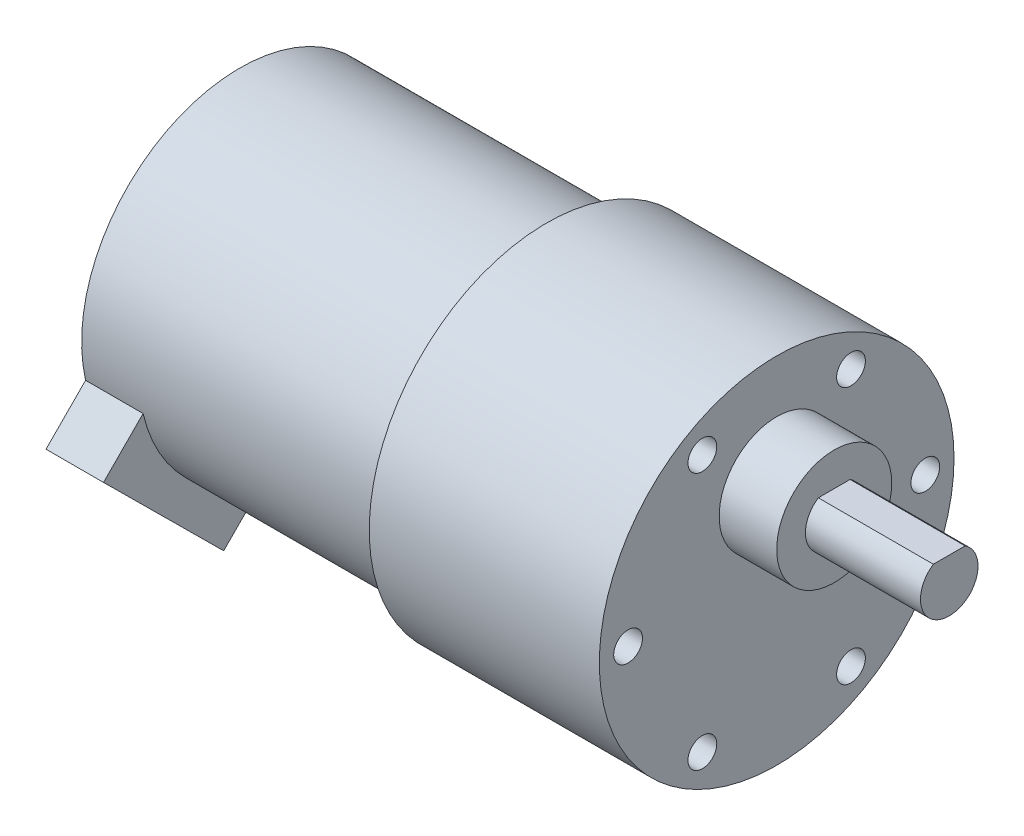
ISO-10303-21;
HEADER;
FILE_DESCRIPTION(('STEP AP214'),'2;1');
FILE_NAME('part.step','',(''),(''),'','','');
FILE_SCHEMA(('AUTOMOTIVE_DESIGN { 1 0 10303 214 1 1 1 1 }'));
ENDSEC;
DATA;
#1=APPLICATION_CONTEXT('core data for automotive mechanical design processes');
#2=APPLICATION_PROTOCOL_DEFINITION('international standard','automotive_design',2000,#1);
#3=PRODUCT_CONTEXT('',#1,'mechanical');
#4=PRODUCT('Part','Part','',(#3));
#5=PRODUCT_RELATED_PRODUCT_CATEGORY('part','',(#4));
#6=PRODUCT_DEFINITION_FORMATION('','',#4);
#7=PRODUCT_DEFINITION_CONTEXT('part definition',#1,'design');
#8=PRODUCT_DEFINITION('design','',#6,#7);
#9=PRODUCT_DEFINITION_SHAPE('','',#8);
#10=(LENGTH_UNIT() NAMED_UNIT(*) SI_UNIT(.MILLI.,.METRE.));
#11=(NAMED_UNIT(*) PLANE_ANGLE_UNIT() SI_UNIT($,.RADIAN.));
#12=(NAMED_UNIT(*) SI_UNIT($,.STERADIAN.) SOLID_ANGLE_UNIT());
#13=UNCERTAINTY_MEASURE_WITH_UNIT(LENGTH_MEASURE(1.E-05),#10,'distance_accuracy_value','');
#14=(GEOMETRIC_REPRESENTATION_CONTEXT(3) GLOBAL_UNCERTAINTY_ASSIGNED_CONTEXT((#13)) GLOBAL_UNIT_ASSIGNED_CONTEXT((#10,
#11,#12)) REPRESENTATION_CONTEXT('',''));
#15=CARTESIAN_POINT('',(0.,0.,0.));
#16=DIRECTION('',(0.,0.,1.));
#17=DIRECTION('',(1.,0.,0.));
#18=AXIS2_PLACEMENT_3D('',#15,#16,#17);
#19=CARTESIAN_POINT('',(30.,7.,0.));
#20=DIRECTION('',(1.,0.,0.));
#21=DIRECTION('',(0.,0.,-1.));
#22=AXIS2_PLACEMENT_3D('',#19,#20,#21);
#23=PLANE('',#22);
#24=CARTESIAN_POINT('',(30.,7.,0.));
#25=DIRECTION('',(1.,0.,0.));
#26=DIRECTION('',(0.,0.,-1.));
#27=AXIS2_PLACEMENT_3D('',#24,#25,#26);
#28=CIRCLE('',#27,6.);
#29=CARTESIAN_POINT('',(30.,7.,-6.));
#30=VERTEX_POINT('',#29);
#31=EDGE_CURVE('E137',#30,#30,#28,.T.);
#32=ORIENTED_EDGE('',*,*,#31,.T.);
#33=EDGE_LOOP('',(#32));
#34=FACE_BOUND('',#33,.T.);
#35=DIRECTION('',(0.,0.,1.));
#36=VECTOR('',#35,1.);
#37=CARTESIAN_POINT('',(30.,9.5,1.6583123951777));
#38=LINE('',#37,#36);
#39=CARTESIAN_POINT('',(30.,9.5,-1.6583123951777));
#40=VERTEX_POINT('',#39);
#41=CARTESIAN_POINT('',(30.,9.5,1.6583123951777));
#42=VERTEX_POINT('',#41);
#43=EDGE_CURVE('E128',#40,#42,#38,.T.);
#44=ORIENTED_EDGE('',*,*,#43,.F.);
#45=CARTESIAN_POINT('',(30.,7.,0.));
#46=DIRECTION('',(1.,0.,0.));
#47=DIRECTION('',(0.,0.,-1.));
#48=AXIS2_PLACEMENT_3D('',#45,#46,#47);
#49=CIRCLE('',#48,3.);
#50=EDGE_CURVE('E58',#42,#40,#49,.T.);
#51=ORIENTED_EDGE('',*,*,#50,.F.);
#52=EDGE_LOOP('',(#44,#51));
#53=FACE_BOUND('',#52,.T.);
#54=ADVANCED_FACE('F35',(#34,#53),#23,.T.);
#55=CARTESIAN_POINT('',(24.,0.,0.));
#56=DIRECTION('',(-1.,0.,0.));
#57=DIRECTION('',(0.,0.,1.));
#58=AXIS2_PLACEMENT_3D('',#55,#56,#57);
#59=CYLINDRICAL_SURFACE('',#58,18.5);
#60=CARTESIAN_POINT('',(24.,0.,0.));
#61=DIRECTION('',(1.,0.,0.));
#62=DIRECTION('',(0.,0.,-1.));
#63=AXIS2_PLACEMENT_3D('',#60,#61,#62);
#64=CIRCLE('',#63,18.5);
#65=CARTESIAN_POINT('',(24.,0.,-18.5));
#66=VERTEX_POINT('',#65);
#67=EDGE_CURVE('E181',#66,#66,#64,.T.);
#68=ORIENTED_EDGE('',*,*,#67,.F.);
#69=EDGE_LOOP('',(#68));
#70=FACE_BOUND('',#69,.T.);
#71=CARTESIAN_POINT('',(0.,0.,0.));
#72=DIRECTION('',(1.,0.,0.));
#73=DIRECTION('',(0.,0.,-1.));
#74=AXIS2_PLACEMENT_3D('',#71,#72,#73);
#75=CIRCLE('',#74,18.5);
#76=CARTESIAN_POINT('',(0.,0.,-18.5));
#77=VERTEX_POINT('',#76);
#78=EDGE_CURVE('E180',#77,#77,#75,.T.);
#79=ORIENTED_EDGE('',*,*,#78,.T.);
#80=EDGE_LOOP('',(#79));
#81=FACE_BOUND('',#80,.T.);
#82=ADVANCED_FACE('F37',(#70,#81),#59,.T.);
#83=CARTESIAN_POINT('',(24.,0.,0.));
#84=DIRECTION('',(1.,0.,0.));
#85=DIRECTION('',(0.,0.,-1.));
#86=AXIS2_PLACEMENT_3D('',#83,#84,#85);
#87=PLANE('',#86);
#88=CARTESIAN_POINT('',(24.,7.,0.));
#89=DIRECTION('',(1.,0.,0.));
#90=DIRECTION('',(0.,0.,-1.));
#91=AXIS2_PLACEMENT_3D('',#88,#89,#90);
#92=CIRCLE('',#91,6.);
#93=CARTESIAN_POINT('',(24.,7.,-6.));
#94=VERTEX_POINT('',#93);
#95=EDGE_CURVE('E136',#94,#94,#92,.T.);
#96=ORIENTED_EDGE('',*,*,#95,.F.);
#97=EDGE_LOOP('',(#96));
#98=FACE_BOUND('',#97,.T.);
#99=CARTESIAN_POINT('',(24.,-13.4233937586588,-7.74999999999997));
#100=DIRECTION('',(1.,0.,0.));
#101=DIRECTION('',(0.,0.,-1.));
#102=AXIS2_PLACEMENT_3D('',#99,#100,#101);
#103=CIRCLE('',#102,1.5);
#104=CARTESIAN_POINT('',(24.,-13.4233937586588,-9.24999999999997));
#105=VERTEX_POINT('',#104);
#106=EDGE_CURVE('E147',#105,#105,#103,.T.);
#107=ORIENTED_EDGE('',*,*,#106,.F.);
#108=EDGE_LOOP('',(#107));
#109=FACE_BOUND('',#108,.T.);
#110=CARTESIAN_POINT('',(24.,-13.4233937586588,7.75000000000006));
#111=DIRECTION('',(1.,0.,0.));
#112=DIRECTION('',(0.,0.,-1.));
#113=AXIS2_PLACEMENT_3D('',#110,#111,#112);
#114=CIRCLE('',#113,1.5);
#115=CARTESIAN_POINT('',(24.,-13.4233937586588,6.25000000000006));
#116=VERTEX_POINT('',#115);
#117=EDGE_CURVE('E153',#116,#116,#114,.T.);
#118=ORIENTED_EDGE('',*,*,#117,.F.);
#119=EDGE_LOOP('',(#118));
#120=FACE_BOUND('',#119,.T.);
#121=CARTESIAN_POINT('',(24.,1.08235921504137E-13,15.5));
#122=DIRECTION('',(1.,0.,0.));
#123=DIRECTION('',(0.,0.,-1.));
#124=AXIS2_PLACEMENT_3D('',#121,#122,#123);
#125=CIRCLE('',#124,1.5);
#126=CARTESIAN_POINT('',(24.,1.08235921504137E-13,14.));
#127=VERTEX_POINT('',#126);
#128=EDGE_CURVE('E159',#127,#127,#125,.T.);
#129=ORIENTED_EDGE('',*,*,#128,.F.);
#130=EDGE_LOOP('',(#129));
#131=FACE_BOUND('',#130,.T.);
#132=CARTESIAN_POINT('',(24.,13.4233937586589,7.74999999999987));
#133=DIRECTION('',(1.,0.,0.));
#134=DIRECTION('',(0.,0.,-1.));
#135=AXIS2_PLACEMENT_3D('',#132,#133,#134);
#136=CIRCLE('',#135,1.5);
#137=CARTESIAN_POINT('',(24.,13.4233937586589,6.24999999999987));
#138=VERTEX_POINT('',#137);
#139=EDGE_CURVE('E165',#138,#138,#136,.T.);
#140=ORIENTED_EDGE('',*,*,#139,.F.);
#141=EDGE_LOOP('',(#140));
#142=FACE_BOUND('',#141,.T.);
#143=CARTESIAN_POINT('',(24.,13.4233937586587,-7.75000000000016));
#144=DIRECTION('',(1.,0.,0.));
#145=DIRECTION('',(0.,0.,-1.));
#146=AXIS2_PLACEMENT_3D('',#143,#144,#145);
#147=CIRCLE('',#146,1.5);
#148=CARTESIAN_POINT('',(24.,13.4233937586587,-9.25000000000016));
#149=VERTEX_POINT('',#148);
#150=EDGE_CURVE('E140',#149,#149,#147,.T.);
#151=ORIENTED_EDGE('',*,*,#150,.F.);
#152=EDGE_LOOP('',(#151));
#153=FACE_BOUND('',#152,.T.);
#154=CARTESIAN_POINT('',(24.,0.,-15.5));
#155=DIRECTION('',(1.,0.,0.));
#156=DIRECTION('',(0.,0.,-1.));
#157=AXIS2_PLACEMENT_3D('',#154,#155,#156);
#158=CIRCLE('',#157,1.5);
#159=CARTESIAN_POINT('',(24.,0.,-17.));
#160=VERTEX_POINT('',#159);
#161=EDGE_CURVE('E146',#160,#160,#158,.T.);
#162=ORIENTED_EDGE('',*,*,#161,.F.);
#163=EDGE_LOOP('',(#162));
#164=FACE_BOUND('',#163,.T.);
#165=ORIENTED_EDGE('',*,*,#67,.T.);
#166=EDGE_LOOP('',(#165));
#167=FACE_BOUND('',#166,.T.);
#168=ADVANCED_FACE('F193',(#98,#109,#120,#131,#142,#153,#164,#167),#87,.T.);
#169=CARTESIAN_POINT('',(0.,0.,0.));
#170=DIRECTION('',(1.,0.,0.));
#171=DIRECTION('',(0.,0.,-1.));
#172=AXIS2_PLACEMENT_3D('',#169,#170,#171);
#173=PLANE('',#172);
#174=CARTESIAN_POINT('',(0.,0.,0.));
#175=DIRECTION('',(1.,0.,0.));
#176=DIRECTION('',(0.,0.,-1.));
#177=AXIS2_PLACEMENT_3D('',#174,#175,#176);
#178=CIRCLE('',#177,16.5);
#179=CARTESIAN_POINT('',(0.,0.,-16.5));
#180=VERTEX_POINT('',#179);
#181=EDGE_CURVE('E43',#180,#180,#178,.F.);
#182=ORIENTED_EDGE('',*,*,#181,.F.);
#183=EDGE_LOOP('',(#182));
#184=FACE_BOUND('',#183,.T.);
#185=ORIENTED_EDGE('',*,*,#78,.F.);
#186=EDGE_LOOP('',(#185));
#187=FACE_BOUND('',#186,.T.);
#188=ADVANCED_FACE('F190',(#184,#187),#173,.F.);
#189=CARTESIAN_POINT('',(-32.,0.,0.));
#190=DIRECTION('',(1.,0.,0.));
#191=DIRECTION('',(0.,0.,-1.));
#192=AXIS2_PLACEMENT_3D('',#189,#190,#191);
#193=CYLINDRICAL_SURFACE('',#192,16.5);
#194=CARTESIAN_POINT('',(-26.,0.,0.));
#195=DIRECTION('',(-1.,0.,0.));
#196=DIRECTION('',(0.,0.,1.));
#197=AXIS2_PLACEMENT_3D('',#194,#195,#196);
#198=CIRCLE('',#197,16.5);
#199=CARTESIAN_POINT('',(-26.,-16.113407128852,3.55079015148199));
#200=VERTEX_POINT('',#199);
#201=CARTESIAN_POINT('',(-26.,-3.66994967252707,16.086686091334));
#202=VERTEX_POINT('',#201);
#203=EDGE_CURVE('E11',#200,#202,#198,.T.);
#204=ORIENTED_EDGE('',*,*,#203,.F.);
#205=DIRECTION('',(-1.,0.,0.));
#206=VECTOR('',#205,1.);
#207=CARTESIAN_POINT('',(-26.,-16.113407128852,3.55079015148199));
#208=LINE('',#207,#206);
#209=CARTESIAN_POINT('',(-32.,-16.113407128852,3.55079015148199));
#210=VERTEX_POINT('',#209);
#211=EDGE_CURVE('E112',#200,#210,#208,.T.);
#212=ORIENTED_EDGE('',*,*,#211,.T.);
#213=CARTESIAN_POINT('',(-32.,0.,0.));
#214=DIRECTION('',(-1.,0.,0.));
#215=DIRECTION('',(0.,0.,1.));
#216=AXIS2_PLACEMENT_3D('',#213,#214,#215);
#217=CIRCLE('',#216,16.5);
#218=CARTESIAN_POINT('',(-32.,-3.66994967252707,16.086686091334));
#219=VERTEX_POINT('',#218);
#220=EDGE_CURVE('E176',#219,#210,#217,.T.);
#221=ORIENTED_EDGE('',*,*,#220,.F.);
#222=DIRECTION('',(-1.,0.,0.));
#223=VECTOR('',#222,1.);
#224=CARTESIAN_POINT('',(-26.,-3.66994967252707,16.086686091334));
#225=LINE('',#224,#223);
#226=EDGE_CURVE('E121',#202,#219,#225,.T.);
#227=ORIENTED_EDGE('',*,*,#226,.F.);
#228=EDGE_LOOP('',(#204,#212,#221,#227));
#229=FACE_BOUND('',#228,.T.);
#230=ORIENTED_EDGE('',*,*,#181,.T.);
#231=EDGE_LOOP('',(#230));
#232=FACE_BOUND('',#231,.T.);
#233=ADVANCED_FACE('F188',(#229,#232),#193,.T.);
#234=CARTESIAN_POINT('',(-32.,0.,0.));
#235=DIRECTION('',(-1.,0.,0.));
#236=DIRECTION('',(0.,0.,1.));
#237=AXIS2_PLACEMENT_3D('',#234,#235,#236);
#238=PLANE('',#237);
#239=ORIENTED_EDGE('',*,*,#220,.T.);
#240=DIRECTION('',(0.,-0.709718637809031,0.704485241255268));
#241=VECTOR('',#240,1.);
#242=CARTESIAN_POINT('',(-32.,-16.113407128852,3.55079015148199));
#243=LINE('',#242,#241);
#244=CARTESIAN_POINT('',(-32.,-20.2741577567813,7.6808598069283));
#245=VERTEX_POINT('',#244);
#246=EDGE_CURVE('E117',#210,#245,#243,.T.);
#247=ORIENTED_EDGE('',*,*,#246,.T.);
#248=DIRECTION('',(0.,0.704485241255268,0.709718637809031));
#249=VECTOR('',#248,1.);
#250=CARTESIAN_POINT('',(-32.,-20.2741577567813,7.6808598069283));
#251=LINE('',#250,#249);
#252=CARTESIAN_POINT('',(-32.,-7.83070030045636,20.2167557467803));
#253=VERTEX_POINT('',#252);
#254=EDGE_CURVE('E95',#245,#253,#251,.T.);
#255=ORIENTED_EDGE('',*,*,#254,.T.);
#256=DIRECTION('',(0.,0.709718637809032,-0.704485241255268));
#257=VECTOR('',#256,1.);
#258=CARTESIAN_POINT('',(-32.,-7.83070030045636,20.2167557467803));
#259=LINE('',#258,#257);
#260=EDGE_CURVE('E50',#253,#219,#259,.T.);
#261=ORIENTED_EDGE('',*,*,#260,.T.);
#262=EDGE_LOOP('',(#239,#247,#255,#261));
#263=FACE_BOUND('',#262,.T.);
#264=ADVANCED_FACE('F266',(#263),#238,.T.);
#265=CARTESIAN_POINT('',(18.,0.,-15.5));
#266=DIRECTION('',(1.,0.,0.));
#267=DIRECTION('',(0.,0.,-1.));
#268=AXIS2_PLACEMENT_3D('',#265,#266,#267);
#269=CYLINDRICAL_SURFACE('',#268,1.5);
#270=CARTESIAN_POINT('',(18.,0.,-15.5));
#271=DIRECTION('',(1.,0.,0.));
#272=DIRECTION('',(0.,0.,-1.));
#273=AXIS2_PLACEMENT_3D('',#270,#271,#272);
#274=CIRCLE('',#273,1.5);
#275=CARTESIAN_POINT('',(18.,0.,-17.));
#276=VERTEX_POINT('',#275);
#277=EDGE_CURVE('E173',#276,#276,#274,.T.);
#278=ORIENTED_EDGE('',*,*,#277,.F.);
#279=EDGE_LOOP('',(#278));
#280=FACE_BOUND('',#279,.T.);
#281=ORIENTED_EDGE('',*,*,#161,.T.);
#282=EDGE_LOOP('',(#281));
#283=FACE_BOUND('',#282,.T.);
#284=ADVANCED_FACE('F262',(#280,#283),#269,.F.);
#285=CARTESIAN_POINT('',(18.,0.,-15.5));
#286=DIRECTION('',(1.,0.,0.));
#287=DIRECTION('',(0.,0.,-1.));
#288=AXIS2_PLACEMENT_3D('',#285,#286,#287);
#289=PLANE('',#288);
#290=ORIENTED_EDGE('',*,*,#277,.T.);
#291=EDGE_LOOP('',(#290));
#292=FACE_BOUND('',#291,.T.);
#293=ADVANCED_FACE('F258',(#292),#289,.T.);
#294=CARTESIAN_POINT('',(18.,13.4233937586587,-7.75000000000016));
#295=DIRECTION('',(1.,0.,0.));
#296=DIRECTION('',(0.,0.,-1.));
#297=AXIS2_PLACEMENT_3D('',#294,#295,#296);
#298=CYLINDRICAL_SURFACE('',#297,1.5);
#299=CARTESIAN_POINT('',(18.,13.4233937586587,-7.75000000000016));
#300=DIRECTION('',(1.,0.,0.));
#301=DIRECTION('',(0.,0.,-1.));
#302=AXIS2_PLACEMENT_3D('',#299,#300,#301);
#303=CIRCLE('',#302,1.5);
#304=CARTESIAN_POINT('',(18.,13.4233937586587,-9.25000000000016));
#305=VERTEX_POINT('',#304);
#306=EDGE_CURVE('E168',#305,#305,#303,.T.);
#307=ORIENTED_EDGE('',*,*,#306,.F.);
#308=EDGE_LOOP('',(#307));
#309=FACE_BOUND('',#308,.T.);
#310=ORIENTED_EDGE('',*,*,#150,.T.);
#311=EDGE_LOOP('',(#310));
#312=FACE_BOUND('',#311,.T.);
#313=ADVANCED_FACE('F254',(#309,#312),#298,.F.);
#314=CARTESIAN_POINT('',(18.,13.4233937586587,-7.75000000000016));
#315=DIRECTION('',(1.,0.,0.));
#316=DIRECTION('',(0.,0.,-1.));
#317=AXIS2_PLACEMENT_3D('',#314,#315,#316);
#318=PLANE('',#317);
#319=ORIENTED_EDGE('',*,*,#306,.T.);
#320=EDGE_LOOP('',(#319));
#321=FACE_BOUND('',#320,.T.);
#322=ADVANCED_FACE('F250',(#321),#318,.T.);
#323=CARTESIAN_POINT('',(18.,13.4233937586589,7.74999999999987));
#324=DIRECTION('',(1.,0.,0.));
#325=DIRECTION('',(0.,0.,-1.));
#326=AXIS2_PLACEMENT_3D('',#323,#324,#325);
#327=CYLINDRICAL_SURFACE('',#326,1.5);
#328=CARTESIAN_POINT('',(18.,13.4233937586589,7.74999999999987));
#329=DIRECTION('',(1.,0.,0.));
#330=DIRECTION('',(0.,0.,-1.));
#331=AXIS2_PLACEMENT_3D('',#328,#329,#330);
#332=CIRCLE('',#331,1.5);
#333=CARTESIAN_POINT('',(18.,13.4233937586589,6.24999999999987));
#334=VERTEX_POINT('',#333);
#335=EDGE_CURVE('E162',#334,#334,#332,.T.);
#336=ORIENTED_EDGE('',*,*,#335,.F.);
#337=EDGE_LOOP('',(#336));
#338=FACE_BOUND('',#337,.T.);
#339=ORIENTED_EDGE('',*,*,#139,.T.);
#340=EDGE_LOOP('',(#339));
#341=FACE_BOUND('',#340,.T.);
#342=ADVANCED_FACE('F246',(#338,#341),#327,.F.);
#343=CARTESIAN_POINT('',(18.,13.4233937586589,7.74999999999987));
#344=DIRECTION('',(1.,0.,0.));
#345=DIRECTION('',(0.,0.,-1.));
#346=AXIS2_PLACEMENT_3D('',#343,#344,#345);
#347=PLANE('',#346);
#348=ORIENTED_EDGE('',*,*,#335,.T.);
#349=EDGE_LOOP('',(#348));
#350=FACE_BOUND('',#349,.T.);
#351=ADVANCED_FACE('F242',(#350),#347,.T.);
#352=CARTESIAN_POINT('',(18.,1.08235921504137E-13,15.5));
#353=DIRECTION('',(1.,0.,0.));
#354=DIRECTION('',(0.,0.,-1.));
#355=AXIS2_PLACEMENT_3D('',#352,#353,#354);
#356=CYLINDRICAL_SURFACE('',#355,1.5);
#357=CARTESIAN_POINT('',(18.,1.08235921504137E-13,15.5));
#358=DIRECTION('',(1.,0.,0.));
#359=DIRECTION('',(0.,0.,-1.));
#360=AXIS2_PLACEMENT_3D('',#357,#358,#359);
#361=CIRCLE('',#360,1.5);
#362=CARTESIAN_POINT('',(18.,1.08235921504137E-13,14.));
#363=VERTEX_POINT('',#362);
#364=EDGE_CURVE('E156',#363,#363,#361,.T.);
#365=ORIENTED_EDGE('',*,*,#364,.F.);
#366=EDGE_LOOP('',(#365));
#367=FACE_BOUND('',#366,.T.);
#368=ORIENTED_EDGE('',*,*,#128,.T.);
#369=EDGE_LOOP('',(#368));
#370=FACE_BOUND('',#369,.T.);
#371=ADVANCED_FACE('F238',(#367,#370),#356,.F.);
#372=CARTESIAN_POINT('',(18.,1.08235921504137E-13,15.5));
#373=DIRECTION('',(1.,0.,0.));
#374=DIRECTION('',(0.,0.,-1.));
#375=AXIS2_PLACEMENT_3D('',#372,#373,#374);
#376=PLANE('',#375);
#377=ORIENTED_EDGE('',*,*,#364,.T.);
#378=EDGE_LOOP('',(#377));
#379=FACE_BOUND('',#378,.T.);
#380=ADVANCED_FACE('F234',(#379),#376,.T.);
#381=CARTESIAN_POINT('',(18.,-13.4233937586588,7.75000000000006));
#382=DIRECTION('',(1.,0.,0.));
#383=DIRECTION('',(0.,0.,-1.));
#384=AXIS2_PLACEMENT_3D('',#381,#382,#383);
#385=CYLINDRICAL_SURFACE('',#384,1.5);
#386=CARTESIAN_POINT('',(18.,-13.4233937586588,7.75000000000006));
#387=DIRECTION('',(1.,0.,0.));
#388=DIRECTION('',(0.,0.,-1.));
#389=AXIS2_PLACEMENT_3D('',#386,#387,#388);
#390=CIRCLE('',#389,1.5);
#391=CARTESIAN_POINT('',(18.,-13.4233937586588,6.25000000000006));
#392=VERTEX_POINT('',#391);
#393=EDGE_CURVE('E150',#392,#392,#390,.T.);
#394=ORIENTED_EDGE('',*,*,#393,.F.);
#395=EDGE_LOOP('',(#394));
#396=FACE_BOUND('',#395,.T.);
#397=ORIENTED_EDGE('',*,*,#117,.T.);
#398=EDGE_LOOP('',(#397));
#399=FACE_BOUND('',#398,.T.);
#400=ADVANCED_FACE('F230',(#396,#399),#385,.F.);
#401=CARTESIAN_POINT('',(18.,-13.4233937586588,7.75000000000006));
#402=DIRECTION('',(1.,0.,0.));
#403=DIRECTION('',(0.,0.,-1.));
#404=AXIS2_PLACEMENT_3D('',#401,#402,#403);
#405=PLANE('',#404);
#406=ORIENTED_EDGE('',*,*,#393,.T.);
#407=EDGE_LOOP('',(#406));
#408=FACE_BOUND('',#407,.T.);
#409=ADVANCED_FACE('F226',(#408),#405,.T.);
#410=CARTESIAN_POINT('',(18.,-13.4233937586588,-7.74999999999997));
#411=DIRECTION('',(1.,0.,0.));
#412=DIRECTION('',(0.,0.,-1.));
#413=AXIS2_PLACEMENT_3D('',#410,#411,#412);
#414=CYLINDRICAL_SURFACE('',#413,1.5);
#415=CARTESIAN_POINT('',(18.,-13.4233937586588,-7.74999999999997));
#416=DIRECTION('',(1.,0.,0.));
#417=DIRECTION('',(0.,0.,-1.));
#418=AXIS2_PLACEMENT_3D('',#415,#416,#417);
#419=CIRCLE('',#418,1.5);
#420=CARTESIAN_POINT('',(18.,-13.4233937586588,-9.24999999999997));
#421=VERTEX_POINT('',#420);
#422=EDGE_CURVE('E143',#421,#421,#419,.T.);
#423=ORIENTED_EDGE('',*,*,#422,.F.);
#424=EDGE_LOOP('',(#423));
#425=FACE_BOUND('',#424,.T.);
#426=ORIENTED_EDGE('',*,*,#106,.T.);
#427=EDGE_LOOP('',(#426));
#428=FACE_BOUND('',#427,.T.);
#429=ADVANCED_FACE('F222',(#425,#428),#414,.F.);
#430=CARTESIAN_POINT('',(18.,-13.4233937586588,-7.74999999999997));
#431=DIRECTION('',(1.,0.,0.));
#432=DIRECTION('',(0.,0.,-1.));
#433=AXIS2_PLACEMENT_3D('',#430,#431,#432);
#434=PLANE('',#433);
#435=ORIENTED_EDGE('',*,*,#422,.T.);
#436=EDGE_LOOP('',(#435));
#437=FACE_BOUND('',#436,.T.);
#438=ADVANCED_FACE('F218',(#437),#434,.T.);
#439=CARTESIAN_POINT('',(30.,7.,0.));
#440=DIRECTION('',(-1.,0.,0.));
#441=DIRECTION('',(0.,0.,1.));
#442=AXIS2_PLACEMENT_3D('',#439,#440,#441);
#443=CYLINDRICAL_SURFACE('',#442,6.);
#444=ORIENTED_EDGE('',*,*,#31,.F.);
#445=EDGE_LOOP('',(#444));
#446=FACE_BOUND('',#445,.T.);
#447=ORIENTED_EDGE('',*,*,#95,.T.);
#448=EDGE_LOOP('',(#447));
#449=FACE_BOUND('',#448,.T.);
#450=ADVANCED_FACE('F215',(#446,#449),#443,.T.);
#451=CARTESIAN_POINT('',(42.,7.,0.));
#452=DIRECTION('',(-1.,0.,0.));
#453=DIRECTION('',(0.,0.,1.));
#454=AXIS2_PLACEMENT_3D('',#451,#452,#453);
#455=CYLINDRICAL_SURFACE('',#454,3.);
#456=ORIENTED_EDGE('',*,*,#50,.T.);
#457=DIRECTION('',(-1.,0.,0.));
#458=VECTOR('',#457,1.);
#459=CARTESIAN_POINT('',(42.,9.5,-1.6583123951777));
#460=LINE('',#459,#458);
#461=CARTESIAN_POINT('',(42.,9.5,-1.6583123951777));
#462=VERTEX_POINT('',#461);
#463=EDGE_CURVE('E134',#462,#40,#460,.T.);
#464=ORIENTED_EDGE('',*,*,#463,.F.);
#465=CARTESIAN_POINT('',(42.,7.,0.));
#466=DIRECTION('',(1.,0.,0.));
#467=DIRECTION('',(0.,0.,-1.));
#468=AXIS2_PLACEMENT_3D('',#465,#466,#467);
#469=CIRCLE('',#468,3.);
#470=CARTESIAN_POINT('',(42.,9.5,1.6583123951777));
#471=VERTEX_POINT('',#470);
#472=EDGE_CURVE('E124',#471,#462,#469,.T.);
#473=ORIENTED_EDGE('',*,*,#472,.F.);
#474=DIRECTION('',(-1.,0.,0.));
#475=VECTOR('',#474,1.);
#476=CARTESIAN_POINT('',(42.,9.5,1.6583123951777));
#477=LINE('',#476,#475);
#478=EDGE_CURVE('E130',#471,#42,#477,.T.);
#479=ORIENTED_EDGE('',*,*,#478,.T.);
#480=EDGE_LOOP('',(#456,#464,#473,#479));
#481=FACE_BOUND('',#480,.T.);
#482=ADVANCED_FACE('F213',(#481),#455,.T.);
#483=CARTESIAN_POINT('',(42.,9.5,1.6583123951777));
#484=DIRECTION('',(0.,-1.,0.));
#485=DIRECTION('',(0.,0.,-1.));
#486=AXIS2_PLACEMENT_3D('',#483,#484,#485);
#487=PLANE('',#486);
#488=ORIENTED_EDGE('',*,*,#43,.T.);
#489=ORIENTED_EDGE('',*,*,#478,.F.);
#490=DIRECTION('',(0.,0.,1.));
#491=VECTOR('',#490,1.);
#492=CARTESIAN_POINT('',(42.,9.5,1.6583123951777));
#493=LINE('',#492,#491);
#494=EDGE_CURVE('E127',#462,#471,#493,.T.);
#495=ORIENTED_EDGE('',*,*,#494,.F.);
#496=ORIENTED_EDGE('',*,*,#463,.T.);
#497=EDGE_LOOP('',(#488,#489,#495,#496));
#498=FACE_BOUND('',#497,.T.);
#499=ADVANCED_FACE('F290',(#498),#487,.F.);
#500=CARTESIAN_POINT('',(42.,7.,0.));
#501=DIRECTION('',(1.,0.,0.));
#502=DIRECTION('',(0.,0.,-1.));
#503=AXIS2_PLACEMENT_3D('',#500,#501,#502);
#504=PLANE('',#503);
#505=ORIENTED_EDGE('',*,*,#472,.T.);
#506=ORIENTED_EDGE('',*,*,#494,.T.);
#507=EDGE_LOOP('',(#505,#506));
#508=FACE_BOUND('',#507,.T.);
#509=ADVANCED_FACE('F285',(#508),#504,.T.);
#510=CARTESIAN_POINT('',(-26.,-16.113407128852,3.55079015148199));
#511=DIRECTION('',(0.,-0.704485241255268,-0.709718637809031));
#512=DIRECTION('',(0.,0.709718637809031,-0.704485241255268));
#513=AXIS2_PLACEMENT_3D('',#510,#511,#512);
#514=PLANE('',#513);
#515=ORIENTED_EDGE('',*,*,#246,.F.);
#516=ORIENTED_EDGE('',*,*,#211,.F.);
#517=DIRECTION('',(0.,-0.709718637809031,0.704485241255268));
#518=VECTOR('',#517,1.);
#519=CARTESIAN_POINT('',(-26.,-16.113407128852,3.55079015148199));
#520=LINE('',#519,#518);
#521=CARTESIAN_POINT('',(-26.,-20.2741577567813,7.6808598069283));
#522=VERTEX_POINT('',#521);
#523=EDGE_CURVE('E106',#200,#522,#520,.T.);
#524=ORIENTED_EDGE('',*,*,#523,.T.);
#525=DIRECTION('',(-1.,0.,0.));
#526=VECTOR('',#525,1.);
#527=CARTESIAN_POINT('',(-26.,-20.2741577567813,7.6808598069283));
#528=LINE('',#527,#526);
#529=EDGE_CURVE('E91',#522,#245,#528,.T.);
#530=ORIENTED_EDGE('',*,*,#529,.T.);
#531=EDGE_LOOP('',(#515,#516,#524,#530));
#532=FACE_BOUND('',#531,.T.);
#533=ADVANCED_FACE('F110',(#532),#514,.T.);
#534=CARTESIAN_POINT('',(-26.,-7.83070030045636,20.2167557467803));
#535=DIRECTION('',(0.,0.704485241255268,0.709718637809032));
#536=DIRECTION('',(0.,-0.709718637809032,0.704485241255268));
#537=AXIS2_PLACEMENT_3D('',#534,#535,#536);
#538=PLANE('',#537);
#539=ORIENTED_EDGE('',*,*,#260,.F.);
#540=DIRECTION('',(-1.,0.,0.));
#541=VECTOR('',#540,1.);
#542=CARTESIAN_POINT('',(-26.,-7.83070030045636,20.2167557467803));
#543=LINE('',#542,#541);
#544=CARTESIAN_POINT('',(-26.,-7.83070030045636,20.2167557467803));
#545=VERTEX_POINT('',#544);
#546=EDGE_CURVE('E99',#545,#253,#543,.T.);
#547=ORIENTED_EDGE('',*,*,#546,.F.);
#548=DIRECTION('',(0.,0.709718637809032,-0.704485241255268));
#549=VECTOR('',#548,1.);
#550=CARTESIAN_POINT('',(-26.,-7.83070030045636,20.2167557467803));
#551=LINE('',#550,#549);
#552=EDGE_CURVE('E100',#545,#202,#551,.T.);
#553=ORIENTED_EDGE('',*,*,#552,.T.);
#554=ORIENTED_EDGE('',*,*,#226,.T.);
#555=EDGE_LOOP('',(#539,#547,#553,#554));
#556=FACE_BOUND('',#555,.T.);
#557=ADVANCED_FACE('F277',(#556),#538,.T.);
#558=CARTESIAN_POINT('',(-26.,-20.2741577567813,7.6808598069283));
#559=DIRECTION('',(0.,-0.709718637809031,0.704485241255268));
#560=DIRECTION('',(0.,-0.704485241255268,-0.709718637809032));
#561=AXIS2_PLACEMENT_3D('',#558,#559,#560);
#562=PLANE('',#561);
#563=ORIENTED_EDGE('',*,*,#254,.F.);
#564=ORIENTED_EDGE('',*,*,#529,.F.);
#565=DIRECTION('',(0.,0.704485241255268,0.709718637809031));
#566=VECTOR('',#565,1.);
#567=CARTESIAN_POINT('',(-26.,-20.2741577567813,7.6808598069283));
#568=LINE('',#567,#566);
#569=EDGE_CURVE('E94',#522,#545,#568,.T.);
#570=ORIENTED_EDGE('',*,*,#569,.T.);
#571=ORIENTED_EDGE('',*,*,#546,.T.);
#572=EDGE_LOOP('',(#563,#564,#570,#571));
#573=FACE_BOUND('',#572,.T.);
#574=ADVANCED_FACE('F93',(#573),#562,.T.);
#575=CARTESIAN_POINT('',(-26.,0.,0.));
#576=DIRECTION('',(-1.,0.,0.));
#577=DIRECTION('',(0.,0.,1.));
#578=AXIS2_PLACEMENT_3D('',#575,#576,#577);
#579=PLANE('',#578);
#580=ORIENTED_EDGE('',*,*,#523,.F.);
#581=ORIENTED_EDGE('',*,*,#203,.T.);
#582=ORIENTED_EDGE('',*,*,#552,.F.);
#583=ORIENTED_EDGE('',*,*,#569,.F.);
#584=EDGE_LOOP('',(#580,#581,#582,#583));
#585=FACE_BOUND('',#584,.T.);
#586=ADVANCED_FACE('F105',(#585),#579,.F.);
#587=CLOSED_SHELL('',(#54,#82,#168,#188,#233,#264,#284,#293,#313,#322,#342,#351,#371,#380,#400,
#409,#429,#438,#450,#482,#499,#509,#533,#557,#574,#586));
#588=MANIFOLD_SOLID_BREP('B2',#587);
#589=ADVANCED_BREP_SHAPE_REPRESENTATION('',(#18,#588),#14);
#590=SHAPE_DEFINITION_REPRESENTATION(#9,#589);
ENDSEC;
END-ISO-10303-21;
